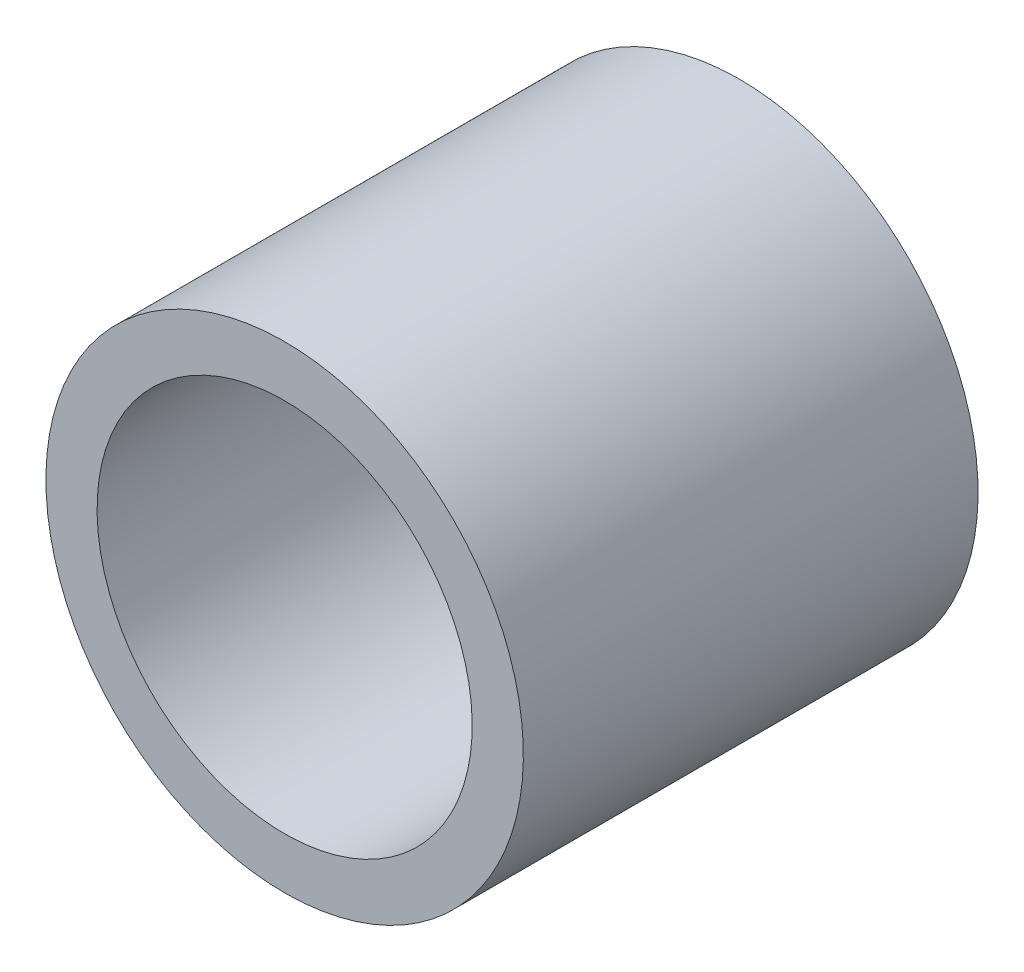
ISO-10303-21;
HEADER;
FILE_DESCRIPTION(('STEP AP214'),'2;1');
FILE_NAME('part.step','',(''),(''),'','','');
FILE_SCHEMA(('AUTOMOTIVE_DESIGN { 1 0 10303 214 1 1 1 1 }'));
ENDSEC;
DATA;
#1=APPLICATION_CONTEXT('core data for automotive mechanical design processes');
#2=APPLICATION_PROTOCOL_DEFINITION('international standard','automotive_design',2000,#1);
#3=PRODUCT_CONTEXT('',#1,'mechanical');
#4=PRODUCT('Part','Part','',(#3));
#5=PRODUCT_RELATED_PRODUCT_CATEGORY('part','',(#4));
#6=PRODUCT_DEFINITION_FORMATION('','',#4);
#7=PRODUCT_DEFINITION_CONTEXT('part definition',#1,'design');
#8=PRODUCT_DEFINITION('design','',#6,#7);
#9=PRODUCT_DEFINITION_SHAPE('','',#8);
#10=(LENGTH_UNIT() NAMED_UNIT(*) SI_UNIT(.MILLI.,.METRE.));
#11=(NAMED_UNIT(*) PLANE_ANGLE_UNIT() SI_UNIT($,.RADIAN.));
#12=(NAMED_UNIT(*) SI_UNIT($,.STERADIAN.) SOLID_ANGLE_UNIT());
#13=UNCERTAINTY_MEASURE_WITH_UNIT(LENGTH_MEASURE(1.E-05),#10,'distance_accuracy_value','');
#14=(GEOMETRIC_REPRESENTATION_CONTEXT(3) GLOBAL_UNCERTAINTY_ASSIGNED_CONTEXT((#13)) GLOBAL_UNIT_ASSIGNED_CONTEXT((#10,
#11,#12)) REPRESENTATION_CONTEXT('',''));
#15=CARTESIAN_POINT('',(0.,0.,0.));
#16=DIRECTION('',(0.,0.,1.));
#17=DIRECTION('',(1.,0.,0.));
#18=AXIS2_PLACEMENT_3D('',#15,#16,#17);
#19=CARTESIAN_POINT('',(-6.49519052838318,3.75000000000089,15.5));
#20=DIRECTION('',(0.,0.,1.));
#21=DIRECTION('',(1.,0.,0.));
#22=AXIS2_PLACEMENT_3D('',#19,#20,#21);
#23=PLANE('',#22);
#24=CARTESIAN_POINT('',(-6.49519052838318,3.75000000000089,15.5));
#25=DIRECTION('',(0.,0.,1.));
#26=DIRECTION('',(-0.5,0.86602540378444,0.));
#27=AXIS2_PLACEMENT_3D('',#24,#25,#26);
#28=CIRCLE('',#27,0.825);
#29=CARTESIAN_POINT('',(-6.90769052838317,4.46447095812306,15.5));
#30=VERTEX_POINT('',#29);
#31=EDGE_CURVE('E11',#30,#30,#28,.T.);
#32=ORIENTED_EDGE('',*,*,#31,.T.);
#33=EDGE_LOOP('',(#32));
#34=FACE_BOUND('',#33,.T.);
#35=CARTESIAN_POINT('',(-6.49519052838318,3.75000000000089,15.5));
#36=DIRECTION('',(0.,0.,1.));
#37=DIRECTION('',(-0.5,0.866025403784439,0.));
#38=AXIS2_PLACEMENT_3D('',#35,#36,#37);
#39=CIRCLE('',#38,1.05);
#40=CARTESIAN_POINT('',(-7.02019052838317,4.65932667397455,15.5));
#41=VERTEX_POINT('',#40);
#42=EDGE_CURVE('E53',#41,#41,#39,.T.);
#43=ORIENTED_EDGE('',*,*,#42,.F.);
#44=EDGE_LOOP('',(#43));
#45=FACE_BOUND('',#44,.T.);
#46=ADVANCED_FACE('F16',(#34,#45),#23,.F.);
#47=CARTESIAN_POINT('',(-6.49519052838318,3.75000000000089,17.5));
#48=DIRECTION('',(0.,0.,1.));
#49=DIRECTION('',(1.,0.,0.));
#50=AXIS2_PLACEMENT_3D('',#47,#48,#49);
#51=PLANE('',#50);
#52=CARTESIAN_POINT('',(-6.49519052838318,3.75000000000089,17.5));
#53=DIRECTION('',(0.,0.,1.));
#54=DIRECTION('',(-0.5,0.86602540378444,0.));
#55=AXIS2_PLACEMENT_3D('',#52,#53,#54);
#56=CIRCLE('',#55,0.825);
#57=CARTESIAN_POINT('',(-6.90769052838317,4.46447095812306,17.5));
#58=VERTEX_POINT('',#57);
#59=EDGE_CURVE('E24',#58,#58,#56,.T.);
#60=ORIENTED_EDGE('',*,*,#59,.F.);
#61=EDGE_LOOP('',(#60));
#62=FACE_BOUND('',#61,.T.);
#63=CARTESIAN_POINT('',(-6.49519052838318,3.75000000000089,17.5));
#64=DIRECTION('',(0.,0.,1.));
#65=DIRECTION('',(-0.5,0.866025403784439,0.));
#66=AXIS2_PLACEMENT_3D('',#63,#64,#65);
#67=CIRCLE('',#66,1.05);
#68=CARTESIAN_POINT('',(-7.02019052838317,4.65932667397455,17.5));
#69=VERTEX_POINT('',#68);
#70=EDGE_CURVE('E49',#69,#69,#67,.T.);
#71=ORIENTED_EDGE('',*,*,#70,.T.);
#72=EDGE_LOOP('',(#71));
#73=FACE_BOUND('',#72,.T.);
#74=ADVANCED_FACE('F50',(#62,#73),#51,.T.);
#75=CARTESIAN_POINT('',(-6.49519052838318,3.75000000000089,17.5));
#76=DIRECTION('',(0.,0.,-1.));
#77=DIRECTION('',(-0.5,0.86602540378444,0.));
#78=AXIS2_PLACEMENT_3D('',#75,#76,#77);
#79=CYLINDRICAL_SURFACE('',#78,0.825);
#80=ORIENTED_EDGE('',*,*,#31,.F.);
#81=EDGE_LOOP('',(#80));
#82=FACE_BOUND('',#81,.T.);
#83=ORIENTED_EDGE('',*,*,#59,.T.);
#84=EDGE_LOOP('',(#83));
#85=FACE_BOUND('',#84,.T.);
#86=ADVANCED_FACE('F75',(#82,#85),#79,.F.);
#87=CARTESIAN_POINT('',(-6.49519052838318,3.75000000000089,17.5));
#88=DIRECTION('',(0.,0.,-1.));
#89=DIRECTION('',(-0.5,0.866025403784439,0.));
#90=AXIS2_PLACEMENT_3D('',#87,#88,#89);
#91=CYLINDRICAL_SURFACE('',#90,1.05);
#92=ORIENTED_EDGE('',*,*,#42,.T.);
#93=EDGE_LOOP('',(#92));
#94=FACE_BOUND('',#93,.T.);
#95=ORIENTED_EDGE('',*,*,#70,.F.);
#96=EDGE_LOOP('',(#95));
#97=FACE_BOUND('',#96,.T.);
#98=ADVANCED_FACE('F82',(#94,#97),#91,.T.);
#99=CLOSED_SHELL('',(#46,#74,#86,#98));
#100=MANIFOLD_SOLID_BREP('B1',#99);
#101=ADVANCED_BREP_SHAPE_REPRESENTATION('',(#18,#100),#14);
#102=SHAPE_DEFINITION_REPRESENTATION(#9,#101);
ENDSEC;
END-ISO-10303-21;
